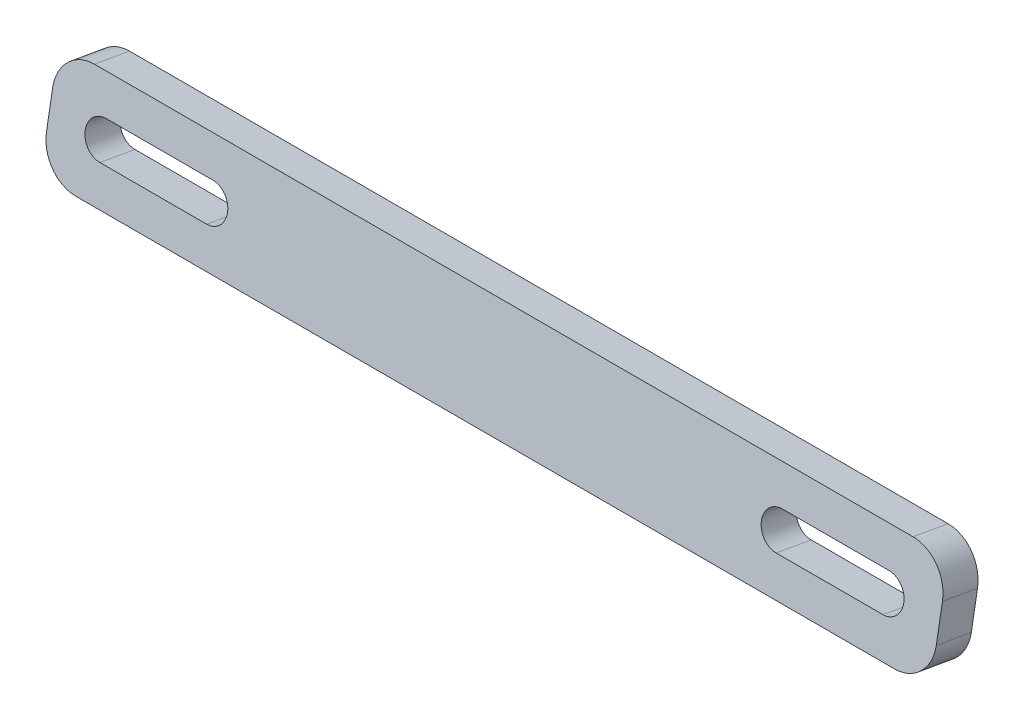
ISO-10303-21;
HEADER;
FILE_DESCRIPTION(('STEP AP214'),'2;1');
FILE_NAME('part.step','',(''),(''),'','','');
FILE_SCHEMA(('AUTOMOTIVE_DESIGN { 1 0 10303 214 1 1 1 1 }'));
ENDSEC;
DATA;
#1=APPLICATION_CONTEXT('core data for automotive mechanical design processes');
#2=APPLICATION_PROTOCOL_DEFINITION('international standard','automotive_design',2000,#1);
#3=PRODUCT_CONTEXT('',#1,'mechanical');
#4=PRODUCT('Part','Part','',(#3));
#5=PRODUCT_RELATED_PRODUCT_CATEGORY('part','',(#4));
#6=PRODUCT_DEFINITION_FORMATION('','',#4);
#7=PRODUCT_DEFINITION_CONTEXT('part definition',#1,'design');
#8=PRODUCT_DEFINITION('design','',#6,#7);
#9=PRODUCT_DEFINITION_SHAPE('','',#8);
#10=(LENGTH_UNIT() NAMED_UNIT(*) SI_UNIT(.MILLI.,.METRE.));
#11=(NAMED_UNIT(*) PLANE_ANGLE_UNIT() SI_UNIT($,.RADIAN.));
#12=(NAMED_UNIT(*) SI_UNIT($,.STERADIAN.) SOLID_ANGLE_UNIT());
#13=UNCERTAINTY_MEASURE_WITH_UNIT(LENGTH_MEASURE(1.E-05),#10,'distance_accuracy_value','');
#14=(GEOMETRIC_REPRESENTATION_CONTEXT(3) GLOBAL_UNCERTAINTY_ASSIGNED_CONTEXT((#13)) GLOBAL_UNIT_ASSIGNED_CONTEXT((#10,
#11,#12)) REPRESENTATION_CONTEXT('',''));
#15=CARTESIAN_POINT('',(0.,0.,0.));
#16=DIRECTION('',(0.,0.,1.));
#17=DIRECTION('',(1.,0.,0.));
#18=AXIS2_PLACEMENT_3D('',#15,#16,#17);
#19=CARTESIAN_POINT('',(-125.,197.899538260513,-194.032432689671));
#20=DIRECTION('',(0.,-0.984807753012244,0.173648177666934));
#21=DIRECTION('',(0.,-0.173648177666934,-0.984807753012244));
#22=AXIS2_PLACEMENT_3D('',#19,#20,#21);
#23=PLANE('',#22);
#24=DIRECTION('',(1.,0.,0.));
#25=VECTOR('',#24,1.);
#26=CARTESIAN_POINT('',(-125.,199.636020037183,-184.184355159546));
#27=LINE('',#26,#25);
#28=CARTESIAN_POINT('',(-114.999999999999,199.636020037183,-184.184355159546));
#29=VERTEX_POINT('',#28);
#30=CARTESIAN_POINT('',(115.,199.636020037183,-184.184355159547));
#31=VERTEX_POINT('',#30);
#32=EDGE_CURVE('E233',#29,#31,#27,.T.);
#33=ORIENTED_EDGE('',*,*,#32,.T.);
#34=DIRECTION('',(0.,-0.173648177666934,-0.984807753012244));
#35=VECTOR('',#34,1.);
#36=CARTESIAN_POINT('',(115.,197.899538260513,-194.032432689672));
#37=LINE('',#36,#35);
#38=CARTESIAN_POINT('',(115.,197.899538260513,-194.032432689672));
#39=VERTEX_POINT('',#38);
#40=EDGE_CURVE('E273',#31,#39,#37,.T.);
#41=ORIENTED_EDGE('',*,*,#40,.T.);
#42=DIRECTION('',(1.,0.,0.));
#43=VECTOR('',#42,1.);
#44=CARTESIAN_POINT('',(-125.,197.899538260513,-194.032432689671));
#45=LINE('',#44,#43);
#46=CARTESIAN_POINT('',(-114.999999999999,197.899538260513,-194.032432689671));
#47=VERTEX_POINT('',#46);
#48=EDGE_CURVE('E246',#47,#39,#45,.T.);
#49=ORIENTED_EDGE('',*,*,#48,.F.);
#50=DIRECTION('',(0.,-0.173648177666934,-0.984807753012244));
#51=VECTOR('',#50,1.);
#52=CARTESIAN_POINT('',(-114.999999999999,197.899538260513,-194.032432689671));
#53=LINE('',#52,#51);
#54=EDGE_CURVE('E271',#47,#29,#53,.F.);
#55=ORIENTED_EDGE('',*,*,#54,.T.);
#56=EDGE_LOOP('',(#33,#41,#49,#55));
#57=FACE_BOUND('',#56,.T.);
#58=ADVANCED_FACE('F36',(#57),#23,.F.);
#59=CARTESIAN_POINT('',(-125.,197.899538260513,-194.032432689671));
#60=DIRECTION('',(0.,0.173648177666933,0.984807753012244));
#61=DIRECTION('',(0.,-0.984807753012244,0.173648177666933));
#62=AXIS2_PLACEMENT_3D('',#59,#60,#61);
#63=PLANE('',#62);
#64=DIRECTION('',(-1.,0.,0.));
#65=VECTOR('',#64,1.);
#66=CARTESIAN_POINT('',(110.,178.203383200265,-190.559469136331));
#67=LINE('',#66,#65);
#68=CARTESIAN_POINT('',(110.,178.203383200265,-190.559469136331));
#69=VERTEX_POINT('',#68);
#70=CARTESIAN_POINT('',(79.9999999999998,178.203383200265,-190.559469136331));
#71=VERTEX_POINT('',#70);
#72=EDGE_CURVE('E179',#69,#71,#67,.T.);
#73=ORIENTED_EDGE('',*,*,#72,.F.);
#74=CARTESIAN_POINT('',(110.,183.127421965326,-191.427710024666));
#75=DIRECTION('',(0.,-0.173648177666933,-0.984807753012244));
#76=DIRECTION('',(0.,0.984807753012244,-0.173648177666933));
#77=AXIS2_PLACEMENT_3D('',#74,#75,#76);
#78=CIRCLE('',#77,5.00000000000003);
#79=CARTESIAN_POINT('',(110.,188.05146073039,-192.295950913001));
#80=VERTEX_POINT('',#79);
#81=EDGE_CURVE('E158',#80,#69,#78,.T.);
#82=ORIENTED_EDGE('',*,*,#81,.F.);
#83=DIRECTION('',(1.,0.,0.));
#84=VECTOR('',#83,1.);
#85=CARTESIAN_POINT('',(110.,188.05146073039,-192.295950913001));
#86=LINE('',#85,#84);
#87=CARTESIAN_POINT('',(79.9999999999998,188.051460730391,-192.295950913001));
#88=VERTEX_POINT('',#87);
#89=EDGE_CURVE('E163',#88,#80,#86,.T.);
#90=ORIENTED_EDGE('',*,*,#89,.F.);
#91=CARTESIAN_POINT('',(79.9999999999998,183.127421965327,-191.427710024666));
#92=DIRECTION('',(0.,-0.173648177666933,-0.984807753012244));
#93=DIRECTION('',(0.,0.984807753012244,-0.173648177666933));
#94=AXIS2_PLACEMENT_3D('',#91,#92,#93);
#95=CIRCLE('',#94,5.00000000000003);
#96=EDGE_CURVE('E186',#71,#88,#95,.T.);
#97=ORIENTED_EDGE('',*,*,#96,.F.);
#98=EDGE_LOOP('',(#73,#82,#90,#97));
#99=FACE_BOUND('',#98,.T.);
#100=DIRECTION('',(1.,0.,0.));
#101=VECTOR('',#100,1.);
#102=CARTESIAN_POINT('',(-110.,188.051460730391,-192.295950913));
#103=LINE('',#102,#101);
#104=CARTESIAN_POINT('',(-110.,188.051460730391,-192.295950913));
#105=VERTEX_POINT('',#104);
#106=CARTESIAN_POINT('',(-80.0000000000001,188.05146073039,-192.295950913));
#107=VERTEX_POINT('',#106);
#108=EDGE_CURVE('E205',#105,#107,#103,.T.);
#109=ORIENTED_EDGE('',*,*,#108,.F.);
#110=CARTESIAN_POINT('',(-110.,183.127421965329,-191.427710024665));
#111=DIRECTION('',(0.,-0.173648177666933,-0.984807753012244));
#112=DIRECTION('',(0.,-0.984807753012244,0.173648177666933));
#113=AXIS2_PLACEMENT_3D('',#110,#111,#112);
#114=CIRCLE('',#113,5.00000000000003);
#115=CARTESIAN_POINT('',(-110.,178.203383200265,-190.55946913633));
#116=VERTEX_POINT('',#115);
#117=EDGE_CURVE('E203',#116,#105,#114,.T.);
#118=ORIENTED_EDGE('',*,*,#117,.F.);
#119=DIRECTION('',(-1.,0.,0.));
#120=VECTOR('',#119,1.);
#121=CARTESIAN_POINT('',(-110.,178.203383200265,-190.55946913633));
#122=LINE('',#121,#120);
#123=CARTESIAN_POINT('',(-80.0000000000002,178.203383200265,-190.559469136331));
#124=VERTEX_POINT('',#123);
#125=EDGE_CURVE('E211',#124,#116,#122,.T.);
#126=ORIENTED_EDGE('',*,*,#125,.F.);
#127=CARTESIAN_POINT('',(-80.0000000000001,183.127421965327,-191.427710024665));
#128=DIRECTION('',(0.,-0.173648177666933,-0.984807753012244));
#129=DIRECTION('',(0.,-0.984807753012244,0.173648177666933));
#130=AXIS2_PLACEMENT_3D('',#127,#128,#129);
#131=CIRCLE('',#130,5.00000000000003);
#132=EDGE_CURVE('E208',#107,#124,#131,.T.);
#133=ORIENTED_EDGE('',*,*,#132,.F.);
#134=EDGE_LOOP('',(#109,#118,#126,#133));
#135=FACE_BOUND('',#134,.T.);
#136=DIRECTION('',(0.,-0.984807753012244,0.173648177666933));
#137=VECTOR('',#136,1.);
#138=CARTESIAN_POINT('',(125.,197.899538260513,-194.032432689672));
#139=LINE('',#138,#137);
#140=CARTESIAN_POINT('',(125.,188.05146073039,-192.295950913001));
#141=VERTEX_POINT('',#140);
#142=CARTESIAN_POINT('',(125.,178.203383200265,-190.559469136331));
#143=VERTEX_POINT('',#142);
#144=EDGE_CURVE('E171',#141,#143,#139,.T.);
#145=ORIENTED_EDGE('',*,*,#144,.T.);
#146=CARTESIAN_POINT('',(115.,178.203383200265,-190.559469136331));
#147=DIRECTION('',(0.,0.173648177666933,0.984807753012244));
#148=DIRECTION('',(0.,-0.984807753012244,0.173648177666933));
#149=AXIS2_PLACEMENT_3D('',#146,#147,#148);
#150=CIRCLE('',#149,10.);
#151=CARTESIAN_POINT('',(115.,168.355305670142,-188.822987359662));
#152=VERTEX_POINT('',#151);
#153=EDGE_CURVE('E269',#143,#152,#150,.F.);
#154=ORIENTED_EDGE('',*,*,#153,.T.);
#155=DIRECTION('',(1.,0.,0.));
#156=VECTOR('',#155,1.);
#157=CARTESIAN_POINT('',(-125.,168.355305670142,-188.822987359661));
#158=LINE('',#157,#156);
#159=CARTESIAN_POINT('',(-115.,168.355305670142,-188.822987359661));
#160=VERTEX_POINT('',#159);
#161=EDGE_CURVE('E243',#160,#152,#158,.T.);
#162=ORIENTED_EDGE('',*,*,#161,.F.);
#163=CARTESIAN_POINT('',(-115.,178.203383200265,-190.55946913633));
#164=DIRECTION('',(0.,0.173648177666933,0.984807753012244));
#165=DIRECTION('',(0.,-0.984807753012244,0.173648177666933));
#166=AXIS2_PLACEMENT_3D('',#163,#164,#165);
#167=CIRCLE('',#166,10.);
#168=CARTESIAN_POINT('',(-125.,178.203383200265,-190.55946913633));
#169=VERTEX_POINT('',#168);
#170=EDGE_CURVE('E266',#160,#169,#167,.F.);
#171=ORIENTED_EDGE('',*,*,#170,.T.);
#172=DIRECTION('',(0.,-0.984807753012244,0.173648177666933));
#173=VECTOR('',#172,1.);
#174=CARTESIAN_POINT('',(-125.,197.899538260513,-194.032432689671));
#175=LINE('',#174,#173);
#176=CARTESIAN_POINT('',(-125.,188.05146073039,-192.295950913));
#177=VERTEX_POINT('',#176);
#178=EDGE_CURVE('E226',#177,#169,#175,.T.);
#179=ORIENTED_EDGE('',*,*,#178,.F.);
#180=CARTESIAN_POINT('',(-115.,188.05146073039,-192.295950913));
#181=DIRECTION('',(0.,0.173648177666933,0.984807753012244));
#182=DIRECTION('',(0.,-0.984807753012244,0.173648177666933));
#183=AXIS2_PLACEMENT_3D('',#180,#181,#182);
#184=CIRCLE('',#183,10.);
#185=EDGE_CURVE('E59',#177,#47,#184,.F.);
#186=ORIENTED_EDGE('',*,*,#185,.T.);
#187=ORIENTED_EDGE('',*,*,#48,.T.);
#188=CARTESIAN_POINT('',(115.,188.05146073039,-192.295950913001));
#189=DIRECTION('',(0.,0.173648177666933,0.984807753012244));
#190=DIRECTION('',(0.,-0.984807753012244,0.173648177666933));
#191=AXIS2_PLACEMENT_3D('',#188,#189,#190);
#192=CIRCLE('',#191,10.);
#193=EDGE_CURVE('E51',#39,#141,#192,.F.);
#194=ORIENTED_EDGE('',*,*,#193,.T.);
#195=EDGE_LOOP('',(#145,#154,#162,#171,#179,#186,#187,#194));
#196=FACE_BOUND('',#195,.T.);
#197=ADVANCED_FACE('F282',(#99,#135,#196),#63,.F.);
#198=CARTESIAN_POINT('',(-125.,170.091787446813,-178.974909829538));
#199=DIRECTION('',(0.,0.984807753012244,-0.173648177666934));
#200=DIRECTION('',(0.,0.173648177666934,0.984807753012244));
#201=AXIS2_PLACEMENT_3D('',#198,#199,#200);
#202=PLANE('',#201);
#203=ORIENTED_EDGE('',*,*,#161,.T.);
#204=DIRECTION('',(0.,0.173648177666934,0.984807753012244));
#205=VECTOR('',#204,1.);
#206=CARTESIAN_POINT('',(115.,170.091787446812,-178.974909829538));
#207=LINE('',#206,#205);
#208=CARTESIAN_POINT('',(115.,170.091787446812,-178.974909829538));
#209=VERTEX_POINT('',#208);
#210=EDGE_CURVE('E250',#152,#209,#207,.T.);
#211=ORIENTED_EDGE('',*,*,#210,.T.);
#212=DIRECTION('',(1.,0.,0.));
#213=VECTOR('',#212,1.);
#214=CARTESIAN_POINT('',(-125.,170.091787446813,-178.974909829538));
#215=LINE('',#214,#213);
#216=CARTESIAN_POINT('',(-115.,170.091787446813,-178.974909829538));
#217=VERTEX_POINT('',#216);
#218=EDGE_CURVE('E240',#217,#209,#215,.T.);
#219=ORIENTED_EDGE('',*,*,#218,.F.);
#220=DIRECTION('',(0.,0.173648177666934,0.984807753012244));
#221=VECTOR('',#220,1.);
#222=CARTESIAN_POINT('',(-115.,170.091787446813,-178.974909829538));
#223=LINE('',#222,#221);
#224=EDGE_CURVE('E248',#217,#160,#223,.F.);
#225=ORIENTED_EDGE('',*,*,#224,.T.);
#226=EDGE_LOOP('',(#203,#211,#219,#225));
#227=FACE_BOUND('',#226,.T.);
#228=ADVANCED_FACE('F305',(#227),#202,.F.);
#229=CARTESIAN_POINT('',(-125.,199.636020037183,-184.184355159546));
#230=DIRECTION('',(0.,-0.173648177666933,-0.984807753012244));
#231=DIRECTION('',(0.,0.984807753012244,-0.173648177666933));
#232=AXIS2_PLACEMENT_3D('',#229,#230,#231);
#233=PLANE('',#232);
#234=DIRECTION('',(-1.,0.,0.));
#235=VECTOR('',#234,1.);
#236=CARTESIAN_POINT('',(110.,189.78794250706,-182.447873382878));
#237=LINE('',#236,#235);
#238=CARTESIAN_POINT('',(110.,189.78794250706,-182.447873382878));
#239=VERTEX_POINT('',#238);
#240=CARTESIAN_POINT('',(79.9999999999998,189.78794250706,-182.447873382878));
#241=VERTEX_POINT('',#240);
#242=EDGE_CURVE('E177',#239,#241,#237,.T.);
#243=ORIENTED_EDGE('',*,*,#242,.F.);
#244=CARTESIAN_POINT('',(110.,184.863903741995,-181.579632494542));
#245=DIRECTION('',(0.,-0.173648177666933,-0.984807753012244));
#246=DIRECTION('',(0.,0.984807753012244,-0.173648177666933));
#247=AXIS2_PLACEMENT_3D('',#244,#245,#246);
#248=CIRCLE('',#247,5.00000000000003);
#249=CARTESIAN_POINT('',(110.000000000001,179.939864976934,-180.711391606207));
#250=VERTEX_POINT('',#249);
#251=EDGE_CURVE('E155',#250,#239,#248,.F.);
#252=ORIENTED_EDGE('',*,*,#251,.F.);
#253=DIRECTION('',(1.,0.,0.));
#254=VECTOR('',#253,1.);
#255=CARTESIAN_POINT('',(110.,179.939864976934,-180.711391606207));
#256=LINE('',#255,#254);
#257=CARTESIAN_POINT('',(79.9999999999998,179.939864976934,-180.711391606207));
#258=VERTEX_POINT('',#257);
#259=EDGE_CURVE('E167',#258,#250,#256,.T.);
#260=ORIENTED_EDGE('',*,*,#259,.F.);
#261=CARTESIAN_POINT('',(79.9999999999998,184.863903741995,-181.579632494542));
#262=DIRECTION('',(0.,-0.173648177666933,-0.984807753012244));
#263=DIRECTION('',(0.,0.984807753012244,-0.173648177666933));
#264=AXIS2_PLACEMENT_3D('',#261,#262,#263);
#265=CIRCLE('',#264,5.00000000000003);
#266=EDGE_CURVE('E181',#241,#258,#265,.F.);
#267=ORIENTED_EDGE('',*,*,#266,.F.);
#268=EDGE_LOOP('',(#243,#252,#260,#267));
#269=FACE_BOUND('',#268,.T.);
#270=DIRECTION('',(1.,0.,0.));
#271=VECTOR('',#270,1.);
#272=CARTESIAN_POINT('',(-110.,179.939864976934,-180.711391606207));
#273=LINE('',#272,#271);
#274=CARTESIAN_POINT('',(-110.,179.939864976934,-180.711391606207));
#275=VERTEX_POINT('',#274);
#276=CARTESIAN_POINT('',(-80.0000000000001,179.939864976934,-180.711391606207));
#277=VERTEX_POINT('',#276);
#278=EDGE_CURVE('E197',#275,#277,#273,.T.);
#279=ORIENTED_EDGE('',*,*,#278,.F.);
#280=CARTESIAN_POINT('',(-110.,184.863903741995,-181.579632494542));
#281=DIRECTION('',(0.,-0.173648177666933,-0.984807753012244));
#282=DIRECTION('',(0.,0.984807753012244,-0.173648177666933));
#283=AXIS2_PLACEMENT_3D('',#280,#281,#282);
#284=CIRCLE('',#283,5.00000000000003);
#285=CARTESIAN_POINT('',(-110.,189.78794250706,-182.447873382878));
#286=VERTEX_POINT('',#285);
#287=EDGE_CURVE('E200',#286,#275,#284,.F.);
#288=ORIENTED_EDGE('',*,*,#287,.F.);
#289=DIRECTION('',(-1.,0.,0.));
#290=VECTOR('',#289,1.);
#291=CARTESIAN_POINT('',(-110.,189.78794250706,-182.447873382878));
#292=LINE('',#291,#290);
#293=CARTESIAN_POINT('',(-80.0000000000001,189.78794250706,-182.447873382878));
#294=VERTEX_POINT('',#293);
#295=EDGE_CURVE('E217',#294,#286,#292,.T.);
#296=ORIENTED_EDGE('',*,*,#295,.F.);
#297=CARTESIAN_POINT('',(-80.0000000000001,184.863903741995,-181.579632494542));
#298=DIRECTION('',(0.,-0.173648177666933,-0.984807753012244));
#299=DIRECTION('',(0.,0.984807753012244,-0.173648177666933));
#300=AXIS2_PLACEMENT_3D('',#297,#298,#299);
#301=CIRCLE('',#300,5.00000000000003);
#302=EDGE_CURVE('E195',#277,#294,#301,.F.);
#303=ORIENTED_EDGE('',*,*,#302,.F.);
#304=EDGE_LOOP('',(#279,#288,#296,#303));
#305=FACE_BOUND('',#304,.T.);
#306=ORIENTED_EDGE('',*,*,#218,.T.);
#307=CARTESIAN_POINT('',(115.,179.939864976934,-180.711391606207));
#308=DIRECTION('',(0.,-0.173648177666933,-0.984807753012244));
#309=DIRECTION('',(0.,0.984807753012244,-0.173648177666933));
#310=AXIS2_PLACEMENT_3D('',#307,#308,#309);
#311=CIRCLE('',#310,10.);
#312=CARTESIAN_POINT('',(125.,179.939864976934,-180.711391606207));
#313=VERTEX_POINT('',#312);
#314=EDGE_CURVE('E259',#209,#313,#311,.F.);
#315=ORIENTED_EDGE('',*,*,#314,.T.);
#316=DIRECTION('',(0.,0.984807753012244,-0.173648177666933));
#317=VECTOR('',#316,1.);
#318=CARTESIAN_POINT('',(125.,199.636020037183,-184.184355159547));
#319=LINE('',#318,#317);
#320=CARTESIAN_POINT('',(125.,189.78794250706,-182.447873382878));
#321=VERTEX_POINT('',#320);
#322=EDGE_CURVE('E230',#313,#321,#319,.T.);
#323=ORIENTED_EDGE('',*,*,#322,.T.);
#324=CARTESIAN_POINT('',(115.,189.78794250706,-182.447873382878));
#325=DIRECTION('',(0.,-0.173648177666933,-0.984807753012244));
#326=DIRECTION('',(0.,0.984807753012244,-0.173648177666933));
#327=AXIS2_PLACEMENT_3D('',#324,#325,#326);
#328=CIRCLE('',#327,10.);
#329=EDGE_CURVE('E257',#321,#31,#328,.F.);
#330=ORIENTED_EDGE('',*,*,#329,.T.);
#331=ORIENTED_EDGE('',*,*,#32,.F.);
#332=CARTESIAN_POINT('',(-115.,189.78794250706,-182.447873382878));
#333=DIRECTION('',(0.,-0.173648177666933,-0.984807753012244));
#334=DIRECTION('',(0.,0.984807753012244,-0.173648177666933));
#335=AXIS2_PLACEMENT_3D('',#332,#333,#334);
#336=CIRCLE('',#335,10.);
#337=CARTESIAN_POINT('',(-125.,189.78794250706,-182.447873382877));
#338=VERTEX_POINT('',#337);
#339=EDGE_CURVE('E253',#29,#338,#336,.F.);
#340=ORIENTED_EDGE('',*,*,#339,.T.);
#341=DIRECTION('',(0.,0.984807753012244,-0.173648177666933));
#342=VECTOR('',#341,1.);
#343=CARTESIAN_POINT('',(-125.,199.636020037183,-184.184355159546));
#344=LINE('',#343,#342);
#345=CARTESIAN_POINT('',(-125.,179.939864976934,-180.711391606207));
#346=VERTEX_POINT('',#345);
#347=EDGE_CURVE('E229',#346,#338,#344,.T.);
#348=ORIENTED_EDGE('',*,*,#347,.F.);
#349=CARTESIAN_POINT('',(-115.,179.939864976934,-180.711391606207));
#350=DIRECTION('',(0.,-0.173648177666933,-0.984807753012244));
#351=DIRECTION('',(0.,0.984807753012244,-0.173648177666933));
#352=AXIS2_PLACEMENT_3D('',#349,#350,#351);
#353=CIRCLE('',#352,10.);
#354=EDGE_CURVE('E255',#346,#217,#353,.F.);
#355=ORIENTED_EDGE('',*,*,#354,.T.);
#356=EDGE_LOOP('',(#306,#315,#323,#330,#331,#340,#348,#355));
#357=FACE_BOUND('',#356,.T.);
#358=ADVANCED_FACE('F174',(#269,#305,#357),#233,.F.);
#359=CARTESIAN_POINT('',(-125.,-0.868240888334593,-4.92403876506086));
#360=DIRECTION('',(1.,0.,0.));
#361=DIRECTION('',(0.,0.,-1.00000000000004));
#362=AXIS2_PLACEMENT_3D('',#359,#360,#361);
#363=PLANE('',#362);
#364=ORIENTED_EDGE('',*,*,#178,.T.);
#365=DIRECTION('',(0.,0.173648177666934,0.984807753012244));
#366=VECTOR('',#365,1.);
#367=CARTESIAN_POINT('',(-124.999999999999,204.549241281022,-41.1446831807173));
#368=LINE('',#367,#366);
#369=EDGE_CURVE('E11',#169,#346,#368,.T.);
#370=ORIENTED_EDGE('',*,*,#369,.T.);
#371=ORIENTED_EDGE('',*,*,#347,.T.);
#372=DIRECTION('',(0.,-0.173648177666934,-0.984807753012244));
#373=VECTOR('',#372,1.);
#374=CARTESIAN_POINT('',(-124.999999999999,214.397318811143,-42.8811649573863));
#375=LINE('',#374,#373);
#376=EDGE_CURVE('E44',#338,#177,#375,.T.);
#377=ORIENTED_EDGE('',*,*,#376,.T.);
#378=EDGE_LOOP('',(#364,#370,#371,#377));
#379=FACE_BOUND('',#378,.T.);
#380=ADVANCED_FACE('F277',(#379),#363,.F.);
#381=CARTESIAN_POINT('',(125.,-0.868240888334759,-4.92403876506131));
#382=DIRECTION('',(1.,0.,0.));
#383=DIRECTION('',(0.,0.,-1.00000000000004));
#384=AXIS2_PLACEMENT_3D('',#381,#382,#383);
#385=PLANE('',#384);
#386=ORIENTED_EDGE('',*,*,#322,.F.);
#387=DIRECTION('',(0.,0.173648177666934,0.984807753012244));
#388=VECTOR('',#387,1.);
#389=CARTESIAN_POINT('',(125.,178.203383200265,-190.559469136331));
#390=LINE('',#389,#388);
#391=EDGE_CURVE('E263',#313,#143,#390,.F.);
#392=ORIENTED_EDGE('',*,*,#391,.T.);
#393=ORIENTED_EDGE('',*,*,#144,.F.);
#394=DIRECTION('',(0.,-0.173648177666934,-0.984807753012244));
#395=VECTOR('',#394,1.);
#396=CARTESIAN_POINT('',(125.,189.78794250706,-182.447873382878));
#397=LINE('',#396,#395);
#398=EDGE_CURVE('E261',#141,#321,#397,.F.);
#399=ORIENTED_EDGE('',*,*,#398,.T.);
#400=EDGE_LOOP('',(#386,#392,#393,#399));
#401=FACE_BOUND('',#400,.T.);
#402=ADVANCED_FACE('F297',(#401),#385,.T.);
#403=CARTESIAN_POINT('',(-109.999999999999,230.681001976968,78.2620437530878));
#404=DIRECTION('',(0.,-0.173648177666933,-0.984807753012244));
#405=DIRECTION('',(0.,0.984807753012244,-0.173648177666933));
#406=AXIS2_PLACEMENT_3D('',#403,#404,#405);
#407=CYLINDRICAL_SURFACE('',#406,5.00000000000003);
#408=ORIENTED_EDGE('',*,*,#287,.T.);
#409=DIRECTION('',(0.,-0.173648177666933,-0.984807753012244));
#410=VECTOR('',#409,1.);
#411=CARTESIAN_POINT('',(-109.999999999999,225.756963211907,79.1302846414225));
#412=LINE('',#411,#410);
#413=EDGE_CURVE('E215',#275,#116,#412,.T.);
#414=ORIENTED_EDGE('',*,*,#413,.T.);
#415=ORIENTED_EDGE('',*,*,#117,.T.);
#416=DIRECTION('',(0.,-0.173648177666933,-0.984807753012244));
#417=VECTOR('',#416,1.);
#418=CARTESIAN_POINT('',(-109.999999999999,235.605040742029,77.393802864754));
#419=LINE('',#418,#417);
#420=EDGE_CURVE('E214',#286,#105,#419,.T.);
#421=ORIENTED_EDGE('',*,*,#420,.F.);
#422=EDGE_LOOP('',(#408,#414,#415,#421));
#423=FACE_BOUND('',#422,.T.);
#424=ADVANCED_FACE('F411',(#423),#407,.F.);
#425=CARTESIAN_POINT('',(-109.999999999999,225.756963211907,79.1302846414225));
#426=DIRECTION('',(0.,-0.984807753012244,0.173648177666933));
#427=DIRECTION('',(0.,-0.173648177666933,-0.984807753012244));
#428=AXIS2_PLACEMENT_3D('',#425,#426,#427);
#429=PLANE('',#428);
#430=ORIENTED_EDGE('',*,*,#278,.T.);
#431=DIRECTION('',(0.,-0.173648177666933,-0.984807753012244));
#432=VECTOR('',#431,1.);
#433=CARTESIAN_POINT('',(-79.9999999999986,225.756963211907,79.1302846414225));
#434=LINE('',#433,#432);
#435=EDGE_CURVE('E218',#277,#124,#434,.T.);
#436=ORIENTED_EDGE('',*,*,#435,.T.);
#437=ORIENTED_EDGE('',*,*,#125,.T.);
#438=ORIENTED_EDGE('',*,*,#413,.F.);
#439=EDGE_LOOP('',(#430,#436,#437,#438));
#440=FACE_BOUND('',#439,.T.);
#441=ADVANCED_FACE('F401',(#440),#429,.F.);
#442=CARTESIAN_POINT('',(-79.9999999999986,230.681001976967,78.2620437530878));
#443=DIRECTION('',(0.,-0.173648177666933,-0.984807753012244));
#444=DIRECTION('',(0.,0.984807753012244,-0.173648177666933));
#445=AXIS2_PLACEMENT_3D('',#442,#443,#444);
#446=CYLINDRICAL_SURFACE('',#445,5.00000000000003);
#447=ORIENTED_EDGE('',*,*,#302,.T.);
#448=DIRECTION('',(0.,-0.173648177666933,-0.984807753012244));
#449=VECTOR('',#448,1.);
#450=CARTESIAN_POINT('',(-79.9999999999986,235.605040742029,77.393802864754));
#451=LINE('',#450,#449);
#452=EDGE_CURVE('E220',#294,#107,#451,.T.);
#453=ORIENTED_EDGE('',*,*,#452,.T.);
#454=ORIENTED_EDGE('',*,*,#132,.T.);
#455=ORIENTED_EDGE('',*,*,#435,.F.);
#456=EDGE_LOOP('',(#447,#453,#454,#455));
#457=FACE_BOUND('',#456,.T.);
#458=ADVANCED_FACE('F391',(#457),#446,.F.);
#459=CARTESIAN_POINT('',(-109.999999999999,235.605040742029,77.393802864754));
#460=DIRECTION('',(0.,0.984807753012244,-0.173648177666933));
#461=DIRECTION('',(0.,0.173648177666933,0.984807753012244));
#462=AXIS2_PLACEMENT_3D('',#459,#460,#461);
#463=PLANE('',#462);
#464=ORIENTED_EDGE('',*,*,#295,.T.);
#465=ORIENTED_EDGE('',*,*,#420,.T.);
#466=ORIENTED_EDGE('',*,*,#108,.T.);
#467=ORIENTED_EDGE('',*,*,#452,.F.);
#468=EDGE_LOOP('',(#464,#465,#466,#467));
#469=FACE_BOUND('',#468,.T.);
#470=ADVANCED_FACE('F382',(#469),#463,.F.);
#471=CARTESIAN_POINT('',(110.000000000001,230.681001976968,78.2620437530869));
#472=DIRECTION('',(0.,-0.173648177666933,-0.984807753012244));
#473=DIRECTION('',(0.,0.984807753012244,-0.173648177666933));
#474=AXIS2_PLACEMENT_3D('',#471,#472,#473);
#475=CYLINDRICAL_SURFACE('',#474,5.00000000000003);
#476=ORIENTED_EDGE('',*,*,#251,.T.);
#477=DIRECTION('',(0.,-0.173648177666933,-0.984807753012244));
#478=VECTOR('',#477,1.);
#479=CARTESIAN_POINT('',(110.000000000001,235.605040742029,77.3938028647531));
#480=LINE('',#479,#478);
#481=EDGE_CURVE('E172',#239,#80,#480,.T.);
#482=ORIENTED_EDGE('',*,*,#481,.T.);
#483=ORIENTED_EDGE('',*,*,#81,.T.);
#484=DIRECTION('',(0.,-0.173648177666933,-0.984807753012244));
#485=VECTOR('',#484,1.);
#486=CARTESIAN_POINT('',(110.000000000001,225.756963211907,79.1302846414216));
#487=LINE('',#486,#485);
#488=EDGE_CURVE('E151',#250,#69,#487,.T.);
#489=ORIENTED_EDGE('',*,*,#488,.F.);
#490=EDGE_LOOP('',(#476,#482,#483,#489));
#491=FACE_BOUND('',#490,.T.);
#492=ADVANCED_FACE('F153',(#491),#475,.F.);
#493=CARTESIAN_POINT('',(110.000000000001,235.605040742029,77.3938028647531));
#494=DIRECTION('',(0.,0.984807753012244,-0.173648177666933));
#495=DIRECTION('',(0.,0.173648177666933,0.984807753012244));
#496=AXIS2_PLACEMENT_3D('',#493,#494,#495);
#497=PLANE('',#496);
#498=ORIENTED_EDGE('',*,*,#242,.T.);
#499=DIRECTION('',(0.,-0.173648177666933,-0.984807753012244));
#500=VECTOR('',#499,1.);
#501=CARTESIAN_POINT('',(80.0000000000012,235.605040742029,77.3938028647536));
#502=LINE('',#501,#500);
#503=EDGE_CURVE('E192',#241,#88,#502,.T.);
#504=ORIENTED_EDGE('',*,*,#503,.T.);
#505=ORIENTED_EDGE('',*,*,#89,.T.);
#506=ORIENTED_EDGE('',*,*,#481,.F.);
#507=EDGE_LOOP('',(#498,#504,#505,#506));
#508=FACE_BOUND('',#507,.T.);
#509=ADVANCED_FACE('F363',(#508),#497,.F.);
#510=CARTESIAN_POINT('',(80.0000000000012,230.681001976968,78.2620437530874));
#511=DIRECTION('',(0.,-0.173648177666933,-0.984807753012244));
#512=DIRECTION('',(0.,0.984807753012244,-0.173648177666933));
#513=AXIS2_PLACEMENT_3D('',#510,#511,#512);
#514=CYLINDRICAL_SURFACE('',#513,5.00000000000003);
#515=ORIENTED_EDGE('',*,*,#266,.T.);
#516=DIRECTION('',(0.,-0.173648177666933,-0.984807753012244));
#517=VECTOR('',#516,1.);
#518=CARTESIAN_POINT('',(80.0000000000012,225.756963211907,79.1302846414221));
#519=LINE('',#518,#517);
#520=EDGE_CURVE('E162',#258,#71,#519,.T.);
#521=ORIENTED_EDGE('',*,*,#520,.T.);
#522=ORIENTED_EDGE('',*,*,#96,.T.);
#523=ORIENTED_EDGE('',*,*,#503,.F.);
#524=EDGE_LOOP('',(#515,#521,#522,#523));
#525=FACE_BOUND('',#524,.T.);
#526=ADVANCED_FACE('F354',(#525),#514,.F.);
#527=CARTESIAN_POINT('',(110.000000000001,225.756963211907,79.1302846414216));
#528=DIRECTION('',(0.,-0.984807753012244,0.173648177666933));
#529=DIRECTION('',(0.,-0.173648177666933,-0.984807753012244));
#530=AXIS2_PLACEMENT_3D('',#527,#528,#529);
#531=PLANE('',#530);
#532=ORIENTED_EDGE('',*,*,#259,.T.);
#533=ORIENTED_EDGE('',*,*,#488,.T.);
#534=ORIENTED_EDGE('',*,*,#72,.T.);
#535=ORIENTED_EDGE('',*,*,#520,.F.);
#536=EDGE_LOOP('',(#532,#533,#534,#535));
#537=FACE_BOUND('',#536,.T.);
#538=ADVANCED_FACE('F168',(#537),#531,.F.);
#539=CARTESIAN_POINT('',(115.,179.939864976934,-180.711391606207));
#540=DIRECTION('',(0.,-0.173648177666934,-0.984807753012244));
#541=DIRECTION('',(0.,0.984807753012244,-0.173648177666934));
#542=AXIS2_PLACEMENT_3D('',#539,#540,#541);
#543=CYLINDRICAL_SURFACE('',#542,10.);
#544=ORIENTED_EDGE('',*,*,#153,.F.);
#545=ORIENTED_EDGE('',*,*,#391,.F.);
#546=ORIENTED_EDGE('',*,*,#314,.F.);
#547=ORIENTED_EDGE('',*,*,#210,.F.);
#548=EDGE_LOOP('',(#544,#545,#546,#547));
#549=FACE_BOUND('',#548,.T.);
#550=ADVANCED_FACE('F302',(#549),#543,.T.);
#551=CARTESIAN_POINT('',(115.,188.05146073039,-192.295950913001));
#552=DIRECTION('',(0.,0.173648177666934,0.984807753012244));
#553=DIRECTION('',(0.,-0.984807753012244,0.173648177666934));
#554=AXIS2_PLACEMENT_3D('',#551,#552,#553);
#555=CYLINDRICAL_SURFACE('',#554,10.);
#556=ORIENTED_EDGE('',*,*,#329,.F.);
#557=ORIENTED_EDGE('',*,*,#398,.F.);
#558=ORIENTED_EDGE('',*,*,#193,.F.);
#559=ORIENTED_EDGE('',*,*,#40,.F.);
#560=EDGE_LOOP('',(#556,#557,#558,#559));
#561=FACE_BOUND('',#560,.T.);
#562=ADVANCED_FACE('F300',(#561),#555,.T.);
#563=CARTESIAN_POINT('',(-114.999999999999,204.549241281022,-41.1446831807173));
#564=DIRECTION('',(0.,0.173648177666934,0.984807753012244));
#565=DIRECTION('',(0.,-0.984807753012244,0.173648177666934));
#566=AXIS2_PLACEMENT_3D('',#563,#564,#565);
#567=CYLINDRICAL_SURFACE('',#566,10.);
#568=ORIENTED_EDGE('',*,*,#170,.F.);
#569=ORIENTED_EDGE('',*,*,#224,.F.);
#570=ORIENTED_EDGE('',*,*,#354,.F.);
#571=ORIENTED_EDGE('',*,*,#369,.F.);
#572=EDGE_LOOP('',(#568,#569,#570,#571));
#573=FACE_BOUND('',#572,.T.);
#574=ADVANCED_FACE('F287',(#573),#567,.T.);
#575=CARTESIAN_POINT('',(-114.999999999999,214.397318811143,-42.8811649573863));
#576=DIRECTION('',(0.,-0.173648177666934,-0.984807753012244));
#577=DIRECTION('',(0.,0.984807753012244,-0.173648177666934));
#578=AXIS2_PLACEMENT_3D('',#575,#576,#577);
#579=CYLINDRICAL_SURFACE('',#578,10.);
#580=ORIENTED_EDGE('',*,*,#339,.F.);
#581=ORIENTED_EDGE('',*,*,#54,.F.);
#582=ORIENTED_EDGE('',*,*,#185,.F.);
#583=ORIENTED_EDGE('',*,*,#376,.F.);
#584=EDGE_LOOP('',(#580,#581,#582,#583));
#585=FACE_BOUND('',#584,.T.);
#586=ADVANCED_FACE('F38',(#585),#579,.T.);
#587=CLOSED_SHELL('',(#58,#197,#228,#358,#380,#402,#424,#441,#458,#470,#492,#509,#526,#538,#550,
#562,#574,#586));
#588=MANIFOLD_SOLID_BREP('B2',#587);
#589=ADVANCED_BREP_SHAPE_REPRESENTATION('',(#18,#588),#14);
#590=SHAPE_DEFINITION_REPRESENTATION(#9,#589);
ENDSEC;
END-ISO-10303-21;
